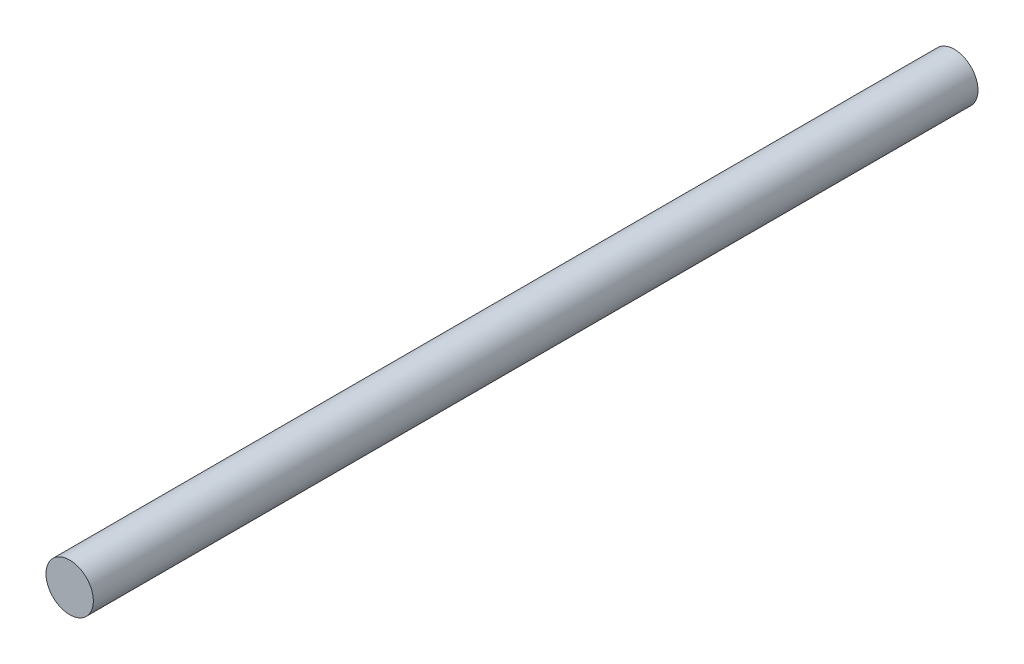
ISO-10303-21;
HEADER;
FILE_DESCRIPTION(('STEP AP214'),'2;1');
FILE_NAME('part.step','',(''),(''),'','','');
FILE_SCHEMA(('AUTOMOTIVE_DESIGN { 1 0 10303 214 1 1 1 1 }'));
ENDSEC;
DATA;
#1=APPLICATION_CONTEXT('core data for automotive mechanical design processes');
#2=APPLICATION_PROTOCOL_DEFINITION('international standard','automotive_design',2000,#1);
#3=PRODUCT_CONTEXT('',#1,'mechanical');
#4=PRODUCT('Part','Part','',(#3));
#5=PRODUCT_RELATED_PRODUCT_CATEGORY('part','',(#4));
#6=PRODUCT_DEFINITION_FORMATION('','',#4);
#7=PRODUCT_DEFINITION_CONTEXT('part definition',#1,'design');
#8=PRODUCT_DEFINITION('design','',#6,#7);
#9=PRODUCT_DEFINITION_SHAPE('','',#8);
#10=(LENGTH_UNIT() NAMED_UNIT(*) SI_UNIT(.MILLI.,.METRE.));
#11=(NAMED_UNIT(*) PLANE_ANGLE_UNIT() SI_UNIT($,.RADIAN.));
#12=(NAMED_UNIT(*) SI_UNIT($,.STERADIAN.) SOLID_ANGLE_UNIT());
#13=UNCERTAINTY_MEASURE_WITH_UNIT(LENGTH_MEASURE(1.E-05),#10,'distance_accuracy_value','');
#14=(GEOMETRIC_REPRESENTATION_CONTEXT(3) GLOBAL_UNCERTAINTY_ASSIGNED_CONTEXT((#13)) GLOBAL_UNIT_ASSIGNED_CONTEXT((#10,
#11,#12)) REPRESENTATION_CONTEXT('',''));
#15=CARTESIAN_POINT('',(0.,0.,0.));
#16=DIRECTION('',(0.,0.,1.));
#17=DIRECTION('',(1.,0.,0.));
#18=AXIS2_PLACEMENT_3D('',#15,#16,#17);
#19=CARTESIAN_POINT('',(0.,0.,355.6));
#20=DIRECTION('',(0.,0.,-1.));
#21=DIRECTION('',(-1.,0.,0.));
#22=AXIS2_PLACEMENT_3D('',#19,#20,#21);
#23=CYLINDRICAL_SURFACE('',#22,9.525);
#24=CARTESIAN_POINT('',(0.,0.,355.6));
#25=DIRECTION('',(0.,0.,1.));
#26=DIRECTION('',(1.,0.,0.));
#27=AXIS2_PLACEMENT_3D('',#24,#25,#26);
#28=CIRCLE('',#27,9.525);
#29=CARTESIAN_POINT('',(9.525,0.,355.6));
#30=VERTEX_POINT('',#29);
#31=EDGE_CURVE('E10',#30,#30,#28,.T.);
#32=ORIENTED_EDGE('',*,*,#31,.F.);
#33=EDGE_LOOP('',(#32));
#34=FACE_BOUND('',#33,.T.);
#35=CARTESIAN_POINT('',(0.,0.,0.));
#36=DIRECTION('',(0.,0.,1.));
#37=DIRECTION('',(1.,0.,0.));
#38=AXIS2_PLACEMENT_3D('',#35,#36,#37);
#39=CIRCLE('',#38,9.525);
#40=CARTESIAN_POINT('',(9.525,0.,0.));
#41=VERTEX_POINT('',#40);
#42=EDGE_CURVE('E45',#41,#41,#39,.T.);
#43=ORIENTED_EDGE('',*,*,#42,.T.);
#44=EDGE_LOOP('',(#43));
#45=FACE_BOUND('',#44,.T.);
#46=ADVANCED_FACE('F42',(#34,#45),#23,.T.);
#47=CARTESIAN_POINT('',(0.,0.,355.6));
#48=DIRECTION('',(0.,0.,1.));
#49=DIRECTION('',(1.,0.,0.));
#50=AXIS2_PLACEMENT_3D('',#47,#48,#49);
#51=PLANE('',#50);
#52=ORIENTED_EDGE('',*,*,#31,.T.);
#53=EDGE_LOOP('',(#52));
#54=FACE_BOUND('',#53,.T.);
#55=ADVANCED_FACE('F59',(#54),#51,.T.);
#56=CARTESIAN_POINT('',(0.,0.,0.));
#57=DIRECTION('',(0.,0.,1.));
#58=DIRECTION('',(1.,0.,0.));
#59=AXIS2_PLACEMENT_3D('',#56,#57,#58);
#60=PLANE('',#59);
#61=ORIENTED_EDGE('',*,*,#42,.F.);
#62=EDGE_LOOP('',(#61));
#63=FACE_BOUND('',#62,.T.);
#64=ADVANCED_FACE('F57',(#63),#60,.F.);
#65=CLOSED_SHELL('',(#46,#55,#64));
#66=MANIFOLD_SOLID_BREP('B2',#65);
#67=ADVANCED_BREP_SHAPE_REPRESENTATION('',(#18,#66),#14);
#68=SHAPE_DEFINITION_REPRESENTATION(#9,#67);
ENDSEC;
END-ISO-10303-21;
